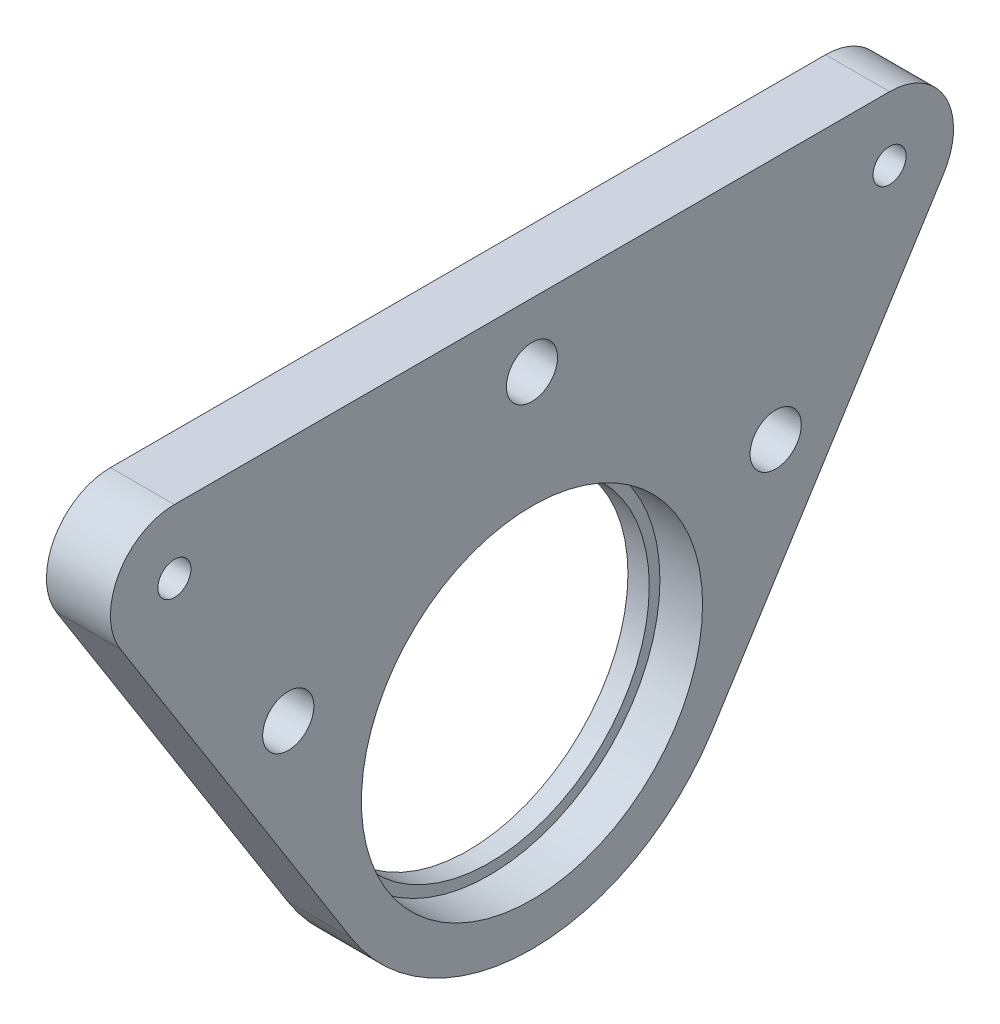
ISO-10303-21;
HEADER;
FILE_DESCRIPTION(('STEP AP214'),'2;1');
FILE_NAME('part.step','',(''),(''),'','','');
FILE_SCHEMA(('AUTOMOTIVE_DESIGN { 1 0 10303 214 1 1 1 1 }'));
ENDSEC;
DATA;
#1=APPLICATION_CONTEXT('core data for automotive mechanical design processes');
#2=APPLICATION_PROTOCOL_DEFINITION('international standard','automotive_design',2000,#1);
#3=PRODUCT_CONTEXT('',#1,'mechanical');
#4=PRODUCT('Part','Part','',(#3));
#5=PRODUCT_RELATED_PRODUCT_CATEGORY('part','',(#4));
#6=PRODUCT_DEFINITION_FORMATION('','',#4);
#7=PRODUCT_DEFINITION_CONTEXT('part definition',#1,'design');
#8=PRODUCT_DEFINITION('design','',#6,#7);
#9=PRODUCT_DEFINITION_SHAPE('','',#8);
#10=(LENGTH_UNIT() NAMED_UNIT(*) SI_UNIT(.MILLI.,.METRE.));
#11=(NAMED_UNIT(*) PLANE_ANGLE_UNIT() SI_UNIT($,.RADIAN.));
#12=(NAMED_UNIT(*) SI_UNIT($,.STERADIAN.) SOLID_ANGLE_UNIT());
#13=UNCERTAINTY_MEASURE_WITH_UNIT(LENGTH_MEASURE(1.E-05),#10,'distance_accuracy_value','');
#14=(GEOMETRIC_REPRESENTATION_CONTEXT(3) GLOBAL_UNCERTAINTY_ASSIGNED_CONTEXT((#13)) GLOBAL_UNIT_ASSIGNED_CONTEXT((#10,
#11,#12)) REPRESENTATION_CONTEXT('',''));
#15=CARTESIAN_POINT('',(0.,0.,0.));
#16=DIRECTION('',(0.,0.,1.));
#17=DIRECTION('',(1.,0.,0.));
#18=AXIS2_PLACEMENT_3D('',#15,#16,#17);
#19=CARTESIAN_POINT('',(2.,0.,0.));
#20=DIRECTION('',(1.,0.,0.));
#21=DIRECTION('',(0.,0.,-1.));
#22=AXIS2_PLACEMENT_3D('',#19,#20,#21);
#23=PLANE('',#22);
#24=CARTESIAN_POINT('',(2.,0.,0.));
#25=DIRECTION('',(1.,0.,0.));
#26=DIRECTION('',(0.,0.,-1.));
#27=AXIS2_PLACEMENT_3D('',#24,#25,#26);
#28=CIRCLE('',#27,15.);
#29=CARTESIAN_POINT('',(2.,0.,-15.));
#30=VERTEX_POINT('',#29);
#31=EDGE_CURVE('E54',#30,#30,#28,.T.);
#32=ORIENTED_EDGE('',*,*,#31,.F.);
#33=EDGE_LOOP('',(#32));
#34=FACE_BOUND('',#33,.T.);
#35=CARTESIAN_POINT('',(2.,0.,0.));
#36=DIRECTION('',(1.,0.,0.));
#37=DIRECTION('',(0.,0.,-1.));
#38=AXIS2_PLACEMENT_3D('',#35,#36,#37);
#39=CIRCLE('',#38,16.);
#40=CARTESIAN_POINT('',(2.,0.,-16.));
#41=VERTEX_POINT('',#40);
#42=EDGE_CURVE('E163',#41,#41,#39,.T.);
#43=ORIENTED_EDGE('',*,*,#42,.T.);
#44=EDGE_LOOP('',(#43));
#45=FACE_BOUND('',#44,.T.);
#46=ADVANCED_FACE('F45',(#34,#45),#23,.T.);
#47=CARTESIAN_POINT('',(0.,0.,0.));
#48=DIRECTION('',(1.,0.,0.));
#49=DIRECTION('',(0.,0.,-1.));
#50=AXIS2_PLACEMENT_3D('',#47,#48,#49);
#51=PLANE('',#50);
#52=CARTESIAN_POINT('',(0.,9.97181490150372,22.856187860574));
#53=DIRECTION('',(1.,0.,0.));
#54=DIRECTION('',(0.,0.,-1.));
#55=AXIS2_PLACEMENT_3D('',#52,#53,#54);
#56=CIRCLE('',#55,2.4);
#57=CARTESIAN_POINT('',(0.,9.97181490150372,20.456187860574));
#58=VERTEX_POINT('',#57);
#59=EDGE_CURVE('E126',#58,#58,#56,.F.);
#60=ORIENTED_EDGE('',*,*,#59,.F.);
#61=EDGE_LOOP('',(#60));
#62=FACE_BOUND('',#61,.T.);
#63=CARTESIAN_POINT('',(0.,9.97181490150372,-22.856187860574));
#64=DIRECTION('',(1.,0.,0.));
#65=DIRECTION('',(0.,0.,-1.));
#66=AXIS2_PLACEMENT_3D('',#63,#64,#65);
#67=CIRCLE('',#66,2.4);
#68=CARTESIAN_POINT('',(0.,9.97181490150372,-25.256187860574));
#69=VERTEX_POINT('',#68);
#70=EDGE_CURVE('E270',#69,#69,#67,.F.);
#71=ORIENTED_EDGE('',*,*,#70,.F.);
#72=EDGE_LOOP('',(#71));
#73=FACE_BOUND('',#72,.T.);
#74=CARTESIAN_POINT('',(0.,26.8817099586865,0.));
#75=DIRECTION('',(1.,0.,0.));
#76=DIRECTION('',(0.,0.,-1.));
#77=AXIS2_PLACEMENT_3D('',#74,#75,#76);
#78=CIRCLE('',#77,2.4);
#79=CARTESIAN_POINT('',(0.,26.8817099586865,-2.4));
#80=VERTEX_POINT('',#79);
#81=EDGE_CURVE('E264',#80,#80,#78,.F.);
#82=ORIENTED_EDGE('',*,*,#81,.F.);
#83=EDGE_LOOP('',(#82));
#84=FACE_BOUND('',#83,.T.);
#85=CARTESIAN_POINT('',(0.,0.,0.));
#86=DIRECTION('',(1.,0.,0.));
#87=DIRECTION('',(0.,0.,-1.));
#88=AXIS2_PLACEMENT_3D('',#85,#86,#87);
#89=CIRCLE('',#88,20.);
#90=CARTESIAN_POINT('',(0.,-10.6796745809535,16.9098950571828));
#91=VERTEX_POINT('',#90);
#92=CARTESIAN_POINT('',(0.,-10.6796745809535,-16.9098950571828));
#93=VERTEX_POINT('',#92);
#94=EDGE_CURVE('E11',#91,#93,#89,.T.);
#95=ORIENTED_EDGE('',*,*,#94,.F.);
#96=DIRECTION('',(0.,0.845494752859142,0.533983729047674));
#97=VECTOR('',#96,1.);
#98=CARTESIAN_POINT('',(0.,23.6778075844005,38.6088309586823));
#99=LINE('',#98,#97);
#100=CARTESIAN_POINT('',(0.,23.6778075844005,38.6088309586823));
#101=VERTEX_POINT('',#100);
#102=EDGE_CURVE('E85',#91,#101,#99,.T.);
#103=ORIENTED_EDGE('',*,*,#102,.T.);
#104=CARTESIAN_POINT('',(0.,26.8817099586865,33.5358624415275));
#105=DIRECTION('',(1.,0.,0.));
#106=DIRECTION('',(0.,0.,-1.));
#107=AXIS2_PLACEMENT_3D('',#104,#105,#106);
#108=CIRCLE('',#107,6.);
#109=CARTESIAN_POINT('',(0.,32.8817099586866,33.5358624415275));
#110=VERTEX_POINT('',#109);
#111=EDGE_CURVE('E70',#101,#110,#108,.F.);
#112=ORIENTED_EDGE('',*,*,#111,.T.);
#113=DIRECTION('',(0.,0.,-1.));
#114=VECTOR('',#113,1.);
#115=CARTESIAN_POINT('',(0.,32.8817099586866,33.5358624415275));
#116=LINE('',#115,#114);
#117=CARTESIAN_POINT('',(0.,32.8817099586866,-33.5358624415275));
#118=VERTEX_POINT('',#117);
#119=EDGE_CURVE('E290',#110,#118,#116,.T.);
#120=ORIENTED_EDGE('',*,*,#119,.T.);
#121=CARTESIAN_POINT('',(0.,26.8817099586866,-33.5358624415275));
#122=DIRECTION('',(1.,0.,0.));
#123=DIRECTION('',(0.,0.,-1.));
#124=AXIS2_PLACEMENT_3D('',#121,#122,#123);
#125=CIRCLE('',#124,6.00000000000001);
#126=CARTESIAN_POINT('',(0.,23.6778075844005,-38.6088309586823));
#127=VERTEX_POINT('',#126);
#128=EDGE_CURVE('E288',#118,#127,#125,.F.);
#129=ORIENTED_EDGE('',*,*,#128,.T.);
#130=DIRECTION('',(0.,-0.845494752859142,0.533983729047674));
#131=VECTOR('',#130,1.);
#132=CARTESIAN_POINT('',(0.,-10.6796745809535,-16.9098950571828));
#133=LINE('',#132,#131);
#134=EDGE_CURVE('E145',#127,#93,#133,.T.);
#135=ORIENTED_EDGE('',*,*,#134,.T.);
#136=EDGE_LOOP('',(#95,#103,#112,#120,#129,#135));
#137=FACE_BOUND('',#136,.T.);
#138=CARTESIAN_POINT('',(0.,0.,0.));
#139=DIRECTION('',(1.,0.,0.));
#140=DIRECTION('',(0.,0.,-1.));
#141=AXIS2_PLACEMENT_3D('',#138,#139,#140);
#142=CIRCLE('',#141,15.);
#143=CARTESIAN_POINT('',(0.,0.,-15.));
#144=VERTEX_POINT('',#143);
#145=EDGE_CURVE('E169',#144,#144,#142,.T.);
#146=ORIENTED_EDGE('',*,*,#145,.T.);
#147=EDGE_LOOP('',(#146));
#148=FACE_BOUND('',#147,.T.);
#149=CARTESIAN_POINT('',(0.,26.8817099586866,-33.5358624415275));
#150=DIRECTION('',(1.,0.,0.));
#151=DIRECTION('',(0.,0.,-1.));
#152=AXIS2_PLACEMENT_3D('',#149,#150,#151);
#153=CIRCLE('',#152,1.55);
#154=CARTESIAN_POINT('',(0.,26.8817099586866,-35.0858624415275));
#155=VERTEX_POINT('',#154);
#156=EDGE_CURVE('E258',#155,#155,#153,.T.);
#157=ORIENTED_EDGE('',*,*,#156,.T.);
#158=EDGE_LOOP('',(#157));
#159=FACE_BOUND('',#158,.T.);
#160=CARTESIAN_POINT('',(0.,26.8817099586865,33.5358624415275));
#161=DIRECTION('',(1.,0.,0.));
#162=DIRECTION('',(0.,0.,-1.));
#163=AXIS2_PLACEMENT_3D('',#160,#161,#162);
#164=CIRCLE('',#163,1.55);
#165=CARTESIAN_POINT('',(0.,26.8817099586865,31.9858624415275));
#166=VERTEX_POINT('',#165);
#167=EDGE_CURVE('E247',#166,#166,#164,.T.);
#168=ORIENTED_EDGE('',*,*,#167,.T.);
#169=EDGE_LOOP('',(#168));
#170=FACE_BOUND('',#169,.T.);
#171=ADVANCED_FACE('F176',(#62,#73,#84,#137,#148,#159,#170),#51,.F.);
#172=CARTESIAN_POINT('',(2.,0.,0.));
#173=DIRECTION('',(-1.,0.,0.));
#174=DIRECTION('',(0.,0.,1.));
#175=AXIS2_PLACEMENT_3D('',#172,#173,#174);
#176=CYLINDRICAL_SURFACE('',#175,20.);
#177=CARTESIAN_POINT('',(6.,0.,0.));
#178=DIRECTION('',(1.,0.,0.));
#179=DIRECTION('',(0.,0.,-1.));
#180=AXIS2_PLACEMENT_3D('',#177,#178,#179);
#181=CIRCLE('',#180,20.);
#182=CARTESIAN_POINT('',(6.,-10.6796745809535,16.9098950571828));
#183=VERTEX_POINT('',#182);
#184=CARTESIAN_POINT('',(6.,-10.6796745809535,-16.9098950571828));
#185=VERTEX_POINT('',#184);
#186=EDGE_CURVE('E162',#183,#185,#181,.T.);
#187=ORIENTED_EDGE('',*,*,#186,.F.);
#188=DIRECTION('',(1.,0.,0.));
#189=VECTOR('',#188,1.);
#190=CARTESIAN_POINT('',(-90.2769732489516,-10.6796745809535,16.9098950571828));
#191=LINE('',#190,#189);
#192=EDGE_CURVE('E114',#91,#183,#191,.T.);
#193=ORIENTED_EDGE('',*,*,#192,.F.);
#194=ORIENTED_EDGE('',*,*,#94,.T.);
#195=DIRECTION('',(1.,0.,0.));
#196=VECTOR('',#195,1.);
#197=CARTESIAN_POINT('',(-90.2769732489516,-10.6796745809535,-16.9098950571828));
#198=LINE('',#197,#196);
#199=EDGE_CURVE('E152',#93,#185,#198,.T.);
#200=ORIENTED_EDGE('',*,*,#199,.T.);
#201=EDGE_LOOP('',(#187,#193,#194,#200));
#202=FACE_BOUND('',#201,.T.);
#203=ADVANCED_FACE('F47',(#202),#176,.T.);
#204=CARTESIAN_POINT('',(2.,0.,0.));
#205=DIRECTION('',(-1.,0.,0.));
#206=DIRECTION('',(0.,0.,1.));
#207=AXIS2_PLACEMENT_3D('',#204,#205,#206);
#208=CYLINDRICAL_SURFACE('',#207,15.);
#209=ORIENTED_EDGE('',*,*,#31,.T.);
#210=EDGE_LOOP('',(#209));
#211=FACE_BOUND('',#210,.T.);
#212=ORIENTED_EDGE('',*,*,#145,.F.);
#213=EDGE_LOOP('',(#212));
#214=FACE_BOUND('',#213,.T.);
#215=ADVANCED_FACE('F179',(#211,#214),#208,.F.);
#216=CARTESIAN_POINT('',(6.,0.,0.));
#217=DIRECTION('',(1.,0.,0.));
#218=DIRECTION('',(0.,0.,-1.));
#219=AXIS2_PLACEMENT_3D('',#216,#217,#218);
#220=PLANE('',#219);
#221=CARTESIAN_POINT('',(6.,9.97181490150372,22.856187860574));
#222=DIRECTION('',(1.,0.,0.));
#223=DIRECTION('',(0.,0.,-1.));
#224=AXIS2_PLACEMENT_3D('',#221,#222,#223);
#225=CIRCLE('',#224,2.4);
#226=CARTESIAN_POINT('',(6.,9.97181490150372,20.456187860574));
#227=VERTEX_POINT('',#226);
#228=EDGE_CURVE('E130',#227,#227,#225,.T.);
#229=ORIENTED_EDGE('',*,*,#228,.F.);
#230=EDGE_LOOP('',(#229));
#231=FACE_BOUND('',#230,.T.);
#232=CARTESIAN_POINT('',(6.,9.97181490150372,-22.856187860574));
#233=DIRECTION('',(1.,0.,0.));
#234=DIRECTION('',(0.,0.,1.));
#235=AXIS2_PLACEMENT_3D('',#232,#233,#234);
#236=CIRCLE('',#235,2.4);
#237=CARTESIAN_POINT('',(6.,9.97181490150372,-20.456187860574));
#238=VERTEX_POINT('',#237);
#239=EDGE_CURVE('E268',#238,#238,#236,.T.);
#240=ORIENTED_EDGE('',*,*,#239,.F.);
#241=EDGE_LOOP('',(#240));
#242=FACE_BOUND('',#241,.T.);
#243=CARTESIAN_POINT('',(6.,26.8817099586865,0.));
#244=DIRECTION('',(1.,0.,0.));
#245=DIRECTION('',(0.,0.,-1.));
#246=AXIS2_PLACEMENT_3D('',#243,#244,#245);
#247=CIRCLE('',#246,2.4);
#248=CARTESIAN_POINT('',(6.,26.8817099586865,-2.4));
#249=VERTEX_POINT('',#248);
#250=EDGE_CURVE('E274',#249,#249,#247,.T.);
#251=ORIENTED_EDGE('',*,*,#250,.F.);
#252=EDGE_LOOP('',(#251));
#253=FACE_BOUND('',#252,.T.);
#254=ORIENTED_EDGE('',*,*,#186,.T.);
#255=DIRECTION('',(0.,0.845494752859141,-0.533983729047674));
#256=VECTOR('',#255,1.);
#257=CARTESIAN_POINT('',(6.,-10.6796745809535,-16.9098950571828));
#258=LINE('',#257,#256);
#259=CARTESIAN_POINT('',(6.,23.6778075844005,-38.6088309586823));
#260=VERTEX_POINT('',#259);
#261=EDGE_CURVE('E120',#185,#260,#258,.T.);
#262=ORIENTED_EDGE('',*,*,#261,.T.);
#263=CARTESIAN_POINT('',(6.,26.8817099586866,-33.5358624415275));
#264=DIRECTION('',(1.,0.,0.));
#265=DIRECTION('',(0.,0.,-1.));
#266=AXIS2_PLACEMENT_3D('',#263,#264,#265);
#267=CIRCLE('',#266,6.00000000000001);
#268=CARTESIAN_POINT('',(6.,32.8817099586866,-33.5358624415275));
#269=VERTEX_POINT('',#268);
#270=EDGE_CURVE('E138',#260,#269,#267,.T.);
#271=ORIENTED_EDGE('',*,*,#270,.T.);
#272=DIRECTION('',(0.,0.,1.));
#273=VECTOR('',#272,1.);
#274=CARTESIAN_POINT('',(6.,32.8817099586866,33.5358624415275));
#275=LINE('',#274,#273);
#276=CARTESIAN_POINT('',(6.,32.8817099586866,33.5358624415275));
#277=VERTEX_POINT('',#276);
#278=EDGE_CURVE('E115',#269,#277,#275,.T.);
#279=ORIENTED_EDGE('',*,*,#278,.T.);
#280=CARTESIAN_POINT('',(6.,26.8817099586865,33.5358624415275));
#281=DIRECTION('',(1.,0.,0.));
#282=DIRECTION('',(0.,0.,-1.));
#283=AXIS2_PLACEMENT_3D('',#280,#281,#282);
#284=CIRCLE('',#283,6.);
#285=CARTESIAN_POINT('',(6.,23.6778075844005,38.6088309586823));
#286=VERTEX_POINT('',#285);
#287=EDGE_CURVE('E111',#277,#286,#284,.T.);
#288=ORIENTED_EDGE('',*,*,#287,.T.);
#289=DIRECTION('',(0.,-0.845494752859141,-0.533983729047673));
#290=VECTOR('',#289,1.);
#291=CARTESIAN_POINT('',(6.,23.6778075844005,38.6088309586823));
#292=LINE('',#291,#290);
#293=EDGE_CURVE('E61',#286,#183,#292,.T.);
#294=ORIENTED_EDGE('',*,*,#293,.T.);
#295=EDGE_LOOP('',(#254,#262,#271,#279,#288,#294));
#296=FACE_BOUND('',#295,.T.);
#297=CARTESIAN_POINT('',(6.,0.,0.));
#298=DIRECTION('',(1.,0.,0.));
#299=DIRECTION('',(0.,0.,-1.));
#300=AXIS2_PLACEMENT_3D('',#297,#298,#299);
#301=CIRCLE('',#300,16.);
#302=CARTESIAN_POINT('',(6.,0.,-16.));
#303=VERTEX_POINT('',#302);
#304=EDGE_CURVE('E158',#303,#303,#301,.T.);
#305=ORIENTED_EDGE('',*,*,#304,.F.);
#306=EDGE_LOOP('',(#305));
#307=FACE_BOUND('',#306,.T.);
#308=CARTESIAN_POINT('',(6.,26.8817099586866,-33.5358624415275));
#309=DIRECTION('',(1.,0.,0.));
#310=DIRECTION('',(0.,0.,-1.));
#311=AXIS2_PLACEMENT_3D('',#308,#309,#310);
#312=CIRCLE('',#311,1.55);
#313=CARTESIAN_POINT('',(6.,26.8817099586866,-35.0858624415275));
#314=VERTEX_POINT('',#313);
#315=EDGE_CURVE('E253',#314,#314,#312,.T.);
#316=ORIENTED_EDGE('',*,*,#315,.F.);
#317=EDGE_LOOP('',(#316));
#318=FACE_BOUND('',#317,.T.);
#319=CARTESIAN_POINT('',(6.,26.8817099586865,33.5358624415275));
#320=DIRECTION('',(1.,0.,0.));
#321=DIRECTION('',(0.,0.,-1.));
#322=AXIS2_PLACEMENT_3D('',#319,#320,#321);
#323=CIRCLE('',#322,1.55);
#324=CARTESIAN_POINT('',(6.,26.8817099586865,31.9858624415275));
#325=VERTEX_POINT('',#324);
#326=EDGE_CURVE('E250',#325,#325,#323,.T.);
#327=ORIENTED_EDGE('',*,*,#326,.F.);
#328=EDGE_LOOP('',(#327));
#329=FACE_BOUND('',#328,.T.);
#330=ADVANCED_FACE('F122',(#231,#242,#253,#296,#307,#318,#329),#220,.T.);
#331=CARTESIAN_POINT('',(6.,0.,0.));
#332=DIRECTION('',(-1.,0.,0.));
#333=DIRECTION('',(0.,0.,1.));
#334=AXIS2_PLACEMENT_3D('',#331,#332,#333);
#335=CYLINDRICAL_SURFACE('',#334,16.);
#336=ORIENTED_EDGE('',*,*,#304,.T.);
#337=EDGE_LOOP('',(#336));
#338=FACE_BOUND('',#337,.T.);
#339=ORIENTED_EDGE('',*,*,#42,.F.);
#340=EDGE_LOOP('',(#339));
#341=FACE_BOUND('',#340,.T.);
#342=ADVANCED_FACE('F188',(#338,#341),#335,.F.);
#343=CARTESIAN_POINT('',(-90.2769732489516,23.6778075844005,38.6088309586823));
#344=DIRECTION('',(0.,-0.533983729047673,0.845494752859141));
#345=DIRECTION('',(0.,-0.845494752859142,-0.533983729047674));
#346=AXIS2_PLACEMENT_3D('',#343,#344,#345);
#347=PLANE('',#346);
#348=ORIENTED_EDGE('',*,*,#102,.F.);
#349=ORIENTED_EDGE('',*,*,#192,.T.);
#350=ORIENTED_EDGE('',*,*,#293,.F.);
#351=DIRECTION('',(1.,0.,0.));
#352=VECTOR('',#351,1.);
#353=CARTESIAN_POINT('',(-90.2769732489516,23.6778075844005,38.6088309586823));
#354=LINE('',#353,#352);
#355=EDGE_CURVE('E109',#101,#286,#354,.T.);
#356=ORIENTED_EDGE('',*,*,#355,.F.);
#357=EDGE_LOOP('',(#348,#349,#350,#356));
#358=FACE_BOUND('',#357,.T.);
#359=ADVANCED_FACE('F117',(#358),#347,.T.);
#360=CARTESIAN_POINT('',(-90.2769732489516,-10.6796745809535,-16.9098950571828));
#361=DIRECTION('',(0.,-0.533983729047674,-0.845494752859141));
#362=DIRECTION('',(0.,0.845494752859142,-0.533983729047674));
#363=AXIS2_PLACEMENT_3D('',#360,#361,#362);
#364=PLANE('',#363);
#365=ORIENTED_EDGE('',*,*,#134,.F.);
#366=DIRECTION('',(1.,0.,0.));
#367=VECTOR('',#366,1.);
#368=CARTESIAN_POINT('',(-90.2769732489516,23.6778075844005,-38.6088309586823));
#369=LINE('',#368,#367);
#370=EDGE_CURVE('E149',#127,#260,#369,.T.);
#371=ORIENTED_EDGE('',*,*,#370,.T.);
#372=ORIENTED_EDGE('',*,*,#261,.F.);
#373=ORIENTED_EDGE('',*,*,#199,.F.);
#374=EDGE_LOOP('',(#365,#371,#372,#373));
#375=FACE_BOUND('',#374,.T.);
#376=ADVANCED_FACE('F208',(#375),#364,.T.);
#377=CARTESIAN_POINT('',(-90.2769732489516,26.8817099586866,-33.5358624415275));
#378=DIRECTION('',(1.,0.,0.));
#379=DIRECTION('',(0.,0.,-1.));
#380=AXIS2_PLACEMENT_3D('',#377,#378,#379);
#381=CYLINDRICAL_SURFACE('',#380,6.00000000000001);
#382=ORIENTED_EDGE('',*,*,#128,.F.);
#383=DIRECTION('',(1.,0.,0.));
#384=VECTOR('',#383,1.);
#385=CARTESIAN_POINT('',(-90.2769732489516,32.8817099586866,-33.5358624415275));
#386=LINE('',#385,#384);
#387=EDGE_CURVE('E146',#118,#269,#386,.T.);
#388=ORIENTED_EDGE('',*,*,#387,.T.);
#389=ORIENTED_EDGE('',*,*,#270,.F.);
#390=ORIENTED_EDGE('',*,*,#370,.F.);
#391=EDGE_LOOP('',(#382,#388,#389,#390));
#392=FACE_BOUND('',#391,.T.);
#393=ADVANCED_FACE('F217',(#392),#381,.T.);
#394=CARTESIAN_POINT('',(-90.2769732489516,32.8817099586866,33.5358624415275));
#395=DIRECTION('',(0.,1.,0.));
#396=DIRECTION('',(0.,0.,1.));
#397=AXIS2_PLACEMENT_3D('',#394,#395,#396);
#398=PLANE('',#397);
#399=ORIENTED_EDGE('',*,*,#119,.F.);
#400=DIRECTION('',(1.,0.,0.));
#401=VECTOR('',#400,1.);
#402=CARTESIAN_POINT('',(-90.2769732489516,32.8817099586866,33.5358624415275));
#403=LINE('',#402,#401);
#404=EDGE_CURVE('E95',#110,#277,#403,.T.);
#405=ORIENTED_EDGE('',*,*,#404,.T.);
#406=ORIENTED_EDGE('',*,*,#278,.F.);
#407=ORIENTED_EDGE('',*,*,#387,.F.);
#408=EDGE_LOOP('',(#399,#405,#406,#407));
#409=FACE_BOUND('',#408,.T.);
#410=ADVANCED_FACE('F213',(#409),#398,.T.);
#411=CARTESIAN_POINT('',(-90.2769732489516,26.8817099586865,33.5358624415275));
#412=DIRECTION('',(1.,0.,0.));
#413=DIRECTION('',(0.,0.,-1.));
#414=AXIS2_PLACEMENT_3D('',#411,#412,#413);
#415=CYLINDRICAL_SURFACE('',#414,6.);
#416=ORIENTED_EDGE('',*,*,#111,.F.);
#417=ORIENTED_EDGE('',*,*,#355,.T.);
#418=ORIENTED_EDGE('',*,*,#287,.F.);
#419=ORIENTED_EDGE('',*,*,#404,.F.);
#420=EDGE_LOOP('',(#416,#417,#418,#419));
#421=FACE_BOUND('',#420,.T.);
#422=ADVANCED_FACE('F110',(#421),#415,.T.);
#423=CARTESIAN_POINT('',(-6.78822509939086,26.8817099586865,0.));
#424=DIRECTION('',(1.,0.,0.));
#425=DIRECTION('',(0.,0.,-1.));
#426=AXIS2_PLACEMENT_3D('',#423,#424,#425);
#427=CYLINDRICAL_SURFACE('',#426,2.4);
#428=ORIENTED_EDGE('',*,*,#81,.T.);
#429=EDGE_LOOP('',(#428));
#430=FACE_BOUND('',#429,.T.);
#431=ORIENTED_EDGE('',*,*,#250,.T.);
#432=EDGE_LOOP('',(#431));
#433=FACE_BOUND('',#432,.T.);
#434=ADVANCED_FACE('F212',(#430,#433),#427,.F.);
#435=CARTESIAN_POINT('',(-6.78822509939086,9.97181490150372,-22.856187860574));
#436=DIRECTION('',(1.,0.,0.));
#437=DIRECTION('',(0.,0.,-1.));
#438=AXIS2_PLACEMENT_3D('',#435,#436,#437);
#439=CYLINDRICAL_SURFACE('',#438,2.4);
#440=ORIENTED_EDGE('',*,*,#70,.T.);
#441=EDGE_LOOP('',(#440));
#442=FACE_BOUND('',#441,.T.);
#443=ORIENTED_EDGE('',*,*,#239,.T.);
#444=EDGE_LOOP('',(#443));
#445=FACE_BOUND('',#444,.T.);
#446=ADVANCED_FACE('F226',(#442,#445),#439,.F.);
#447=CARTESIAN_POINT('',(-6.78822509939086,9.97181490150372,22.856187860574));
#448=DIRECTION('',(1.,0.,0.));
#449=DIRECTION('',(0.,0.,-1.));
#450=AXIS2_PLACEMENT_3D('',#447,#448,#449);
#451=CYLINDRICAL_SURFACE('',#450,2.4);
#452=ORIENTED_EDGE('',*,*,#59,.T.);
#453=EDGE_LOOP('',(#452));
#454=FACE_BOUND('',#453,.T.);
#455=ORIENTED_EDGE('',*,*,#228,.T.);
#456=EDGE_LOOP('',(#455));
#457=FACE_BOUND('',#456,.T.);
#458=ADVANCED_FACE('F230',(#454,#457),#451,.F.);
#459=CARTESIAN_POINT('',(11.6568542494924,26.8817099586866,-33.5358624415275));
#460=DIRECTION('',(-1.,0.,0.));
#461=DIRECTION('',(0.,0.,1.));
#462=AXIS2_PLACEMENT_3D('',#459,#460,#461);
#463=CYLINDRICAL_SURFACE('',#462,1.55);
#464=ORIENTED_EDGE('',*,*,#156,.F.);
#465=EDGE_LOOP('',(#464));
#466=FACE_BOUND('',#465,.T.);
#467=ORIENTED_EDGE('',*,*,#315,.T.);
#468=EDGE_LOOP('',(#467));
#469=FACE_BOUND('',#468,.T.);
#470=ADVANCED_FACE('F234',(#466,#469),#463,.F.);
#471=CARTESIAN_POINT('',(11.6568542494924,26.8817099586865,33.5358624415275));
#472=DIRECTION('',(-1.,0.,0.));
#473=DIRECTION('',(0.,0.,1.));
#474=AXIS2_PLACEMENT_3D('',#471,#472,#473);
#475=CYLINDRICAL_SURFACE('',#474,1.55);
#476=ORIENTED_EDGE('',*,*,#167,.F.);
#477=EDGE_LOOP('',(#476));
#478=FACE_BOUND('',#477,.T.);
#479=ORIENTED_EDGE('',*,*,#326,.T.);
#480=EDGE_LOOP('',(#479));
#481=FACE_BOUND('',#480,.T.);
#482=ADVANCED_FACE('F238',(#478,#481),#475,.F.);
#483=CLOSED_SHELL('',(#46,#171,#203,#215,#330,#342,#359,#376,#393,#410,#422,#434,#446,#458,#470,#482));
#484=MANIFOLD_SOLID_BREP('B2',#483);
#485=ADVANCED_BREP_SHAPE_REPRESENTATION('',(#18,#484),#14);
#486=SHAPE_DEFINITION_REPRESENTATION(#9,#485);
ENDSEC;
END-ISO-10303-21;
